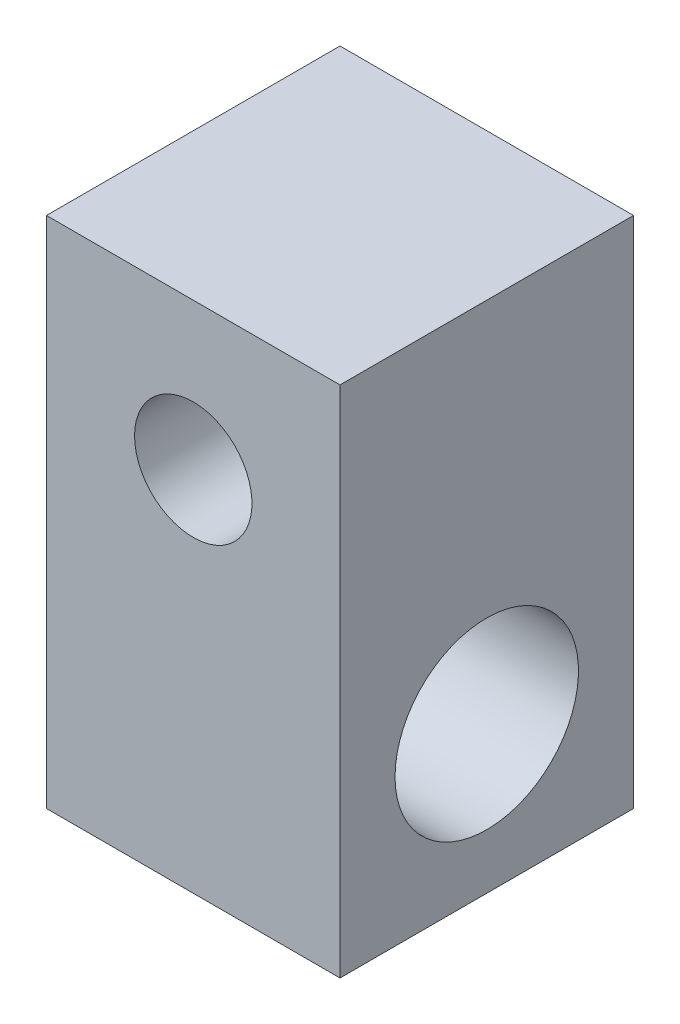
ISO-10303-21;
HEADER;
FILE_DESCRIPTION(('STEP AP214'),'2;1');
FILE_NAME('part.step','',(''),(''),'','','');
FILE_SCHEMA(('AUTOMOTIVE_DESIGN { 1 0 10303 214 1 1 1 1 }'));
ENDSEC;
DATA;
#1=APPLICATION_CONTEXT('core data for automotive mechanical design processes');
#2=APPLICATION_PROTOCOL_DEFINITION('international standard','automotive_design',2000,#1);
#3=PRODUCT_CONTEXT('',#1,'mechanical');
#4=PRODUCT('Part','Part','',(#3));
#5=PRODUCT_RELATED_PRODUCT_CATEGORY('part','',(#4));
#6=PRODUCT_DEFINITION_FORMATION('','',#4);
#7=PRODUCT_DEFINITION_CONTEXT('part definition',#1,'design');
#8=PRODUCT_DEFINITION('design','',#6,#7);
#9=PRODUCT_DEFINITION_SHAPE('','',#8);
#10=(LENGTH_UNIT() NAMED_UNIT(*) SI_UNIT(.MILLI.,.METRE.));
#11=(NAMED_UNIT(*) PLANE_ANGLE_UNIT() SI_UNIT($,.RADIAN.));
#12=(NAMED_UNIT(*) SI_UNIT($,.STERADIAN.) SOLID_ANGLE_UNIT());
#13=UNCERTAINTY_MEASURE_WITH_UNIT(LENGTH_MEASURE(1.E-05),#10,'distance_accuracy_value','');
#14=(GEOMETRIC_REPRESENTATION_CONTEXT(3) GLOBAL_UNCERTAINTY_ASSIGNED_CONTEXT((#13)) GLOBAL_UNIT_ASSIGNED_CONTEXT((#10,
#11,#12)) REPRESENTATION_CONTEXT('',''));
#15=CARTESIAN_POINT('',(0.,0.,0.));
#16=DIRECTION('',(0.,0.,1.));
#17=DIRECTION('',(1.,0.,0.));
#18=AXIS2_PLACEMENT_3D('',#15,#16,#17);
#19=CARTESIAN_POINT('',(-4.,-7.,8.));
#20=DIRECTION('',(1.,0.,0.));
#21=DIRECTION('',(0.,0.,-1.));
#22=AXIS2_PLACEMENT_3D('',#19,#20,#21);
#23=PLANE('',#22);
#24=CARTESIAN_POINT('',(-4.,-2.99999999999999,4.));
#25=DIRECTION('',(-1.,0.,0.));
#26=DIRECTION('',(0.,0.,1.));
#27=AXIS2_PLACEMENT_3D('',#24,#25,#26);
#28=CIRCLE('',#27,2.5);
#29=CARTESIAN_POINT('',(-4.,-2.99999999999999,6.5));
#30=VERTEX_POINT('',#29);
#31=EDGE_CURVE('E114',#30,#30,#28,.T.);
#32=ORIENTED_EDGE('',*,*,#31,.F.);
#33=EDGE_LOOP('',(#32));
#34=FACE_BOUND('',#33,.T.);
#35=DIRECTION('',(0.,-1.,0.));
#36=VECTOR('',#35,1.);
#37=CARTESIAN_POINT('',(-4.,-7.,0.));
#38=LINE('',#37,#36);
#39=CARTESIAN_POINT('',(-4.,7.,0.));
#40=VERTEX_POINT('',#39);
#41=CARTESIAN_POINT('',(-4.,-7.,0.));
#42=VERTEX_POINT('',#41);
#43=EDGE_CURVE('E94',#40,#42,#38,.T.);
#44=ORIENTED_EDGE('',*,*,#43,.T.);
#45=DIRECTION('',(0.,0.,-1.));
#46=VECTOR('',#45,1.);
#47=CARTESIAN_POINT('',(-4.,-7.,8.));
#48=LINE('',#47,#46);
#49=CARTESIAN_POINT('',(-4.,-7.,8.));
#50=VERTEX_POINT('',#49);
#51=EDGE_CURVE('E11',#50,#42,#48,.T.);
#52=ORIENTED_EDGE('',*,*,#51,.F.);
#53=DIRECTION('',(0.,-1.,0.));
#54=VECTOR('',#53,1.);
#55=CARTESIAN_POINT('',(-4.,-7.,8.));
#56=LINE('',#55,#54);
#57=CARTESIAN_POINT('',(-4.,7.,8.));
#58=VERTEX_POINT('',#57);
#59=EDGE_CURVE('E82',#58,#50,#56,.T.);
#60=ORIENTED_EDGE('',*,*,#59,.F.);
#61=DIRECTION('',(0.,0.,-1.));
#62=VECTOR('',#61,1.);
#63=CARTESIAN_POINT('',(-4.,7.,8.));
#64=LINE('',#63,#62);
#65=EDGE_CURVE('E90',#58,#40,#64,.T.);
#66=ORIENTED_EDGE('',*,*,#65,.T.);
#67=EDGE_LOOP('',(#44,#52,#60,#66));
#68=FACE_BOUND('',#67,.T.);
#69=ADVANCED_FACE('F31',(#34,#68),#23,.F.);
#70=CARTESIAN_POINT('',(4.,-7.,8.));
#71=DIRECTION('',(0.,1.,0.));
#72=DIRECTION('',(-1.,0.,0.));
#73=AXIS2_PLACEMENT_3D('',#70,#71,#72);
#74=PLANE('',#73);
#75=DIRECTION('',(1.,0.,0.));
#76=VECTOR('',#75,1.);
#77=CARTESIAN_POINT('',(4.,-7.,0.));
#78=LINE('',#77,#76);
#79=CARTESIAN_POINT('',(4.,-7.,0.));
#80=VERTEX_POINT('',#79);
#81=EDGE_CURVE('E86',#42,#80,#78,.T.);
#82=ORIENTED_EDGE('',*,*,#81,.T.);
#83=DIRECTION('',(0.,0.,-1.));
#84=VECTOR('',#83,1.);
#85=CARTESIAN_POINT('',(4.,-7.,8.));
#86=LINE('',#85,#84);
#87=CARTESIAN_POINT('',(4.,-7.,8.));
#88=VERTEX_POINT('',#87);
#89=EDGE_CURVE('E39',#88,#80,#86,.T.);
#90=ORIENTED_EDGE('',*,*,#89,.F.);
#91=DIRECTION('',(1.,0.,0.));
#92=VECTOR('',#91,1.);
#93=CARTESIAN_POINT('',(4.,-7.,8.));
#94=LINE('',#93,#92);
#95=EDGE_CURVE('E77',#50,#88,#94,.T.);
#96=ORIENTED_EDGE('',*,*,#95,.F.);
#97=ORIENTED_EDGE('',*,*,#51,.T.);
#98=EDGE_LOOP('',(#82,#90,#96,#97));
#99=FACE_BOUND('',#98,.T.);
#100=ADVANCED_FACE('F85',(#99),#74,.F.);
#101=CARTESIAN_POINT('',(4.,-7.,8.));
#102=DIRECTION('',(-1.,0.,0.));
#103=DIRECTION('',(0.,0.,1.));
#104=AXIS2_PLACEMENT_3D('',#101,#102,#103);
#105=PLANE('',#104);
#106=CARTESIAN_POINT('',(4.,-2.99999999999999,4.));
#107=DIRECTION('',(-1.,0.,0.));
#108=DIRECTION('',(0.,0.,1.));
#109=AXIS2_PLACEMENT_3D('',#106,#107,#108);
#110=CIRCLE('',#109,2.5);
#111=CARTESIAN_POINT('',(4.,-2.99999999999999,6.5));
#112=VERTEX_POINT('',#111);
#113=EDGE_CURVE('E111',#112,#112,#110,.T.);
#114=ORIENTED_EDGE('',*,*,#113,.T.);
#115=EDGE_LOOP('',(#114));
#116=FACE_BOUND('',#115,.T.);
#117=DIRECTION('',(0.,1.,0.));
#118=VECTOR('',#117,1.);
#119=CARTESIAN_POINT('',(4.,-7.,0.));
#120=LINE('',#119,#118);
#121=CARTESIAN_POINT('',(4.,7.,0.));
#122=VERTEX_POINT('',#121);
#123=EDGE_CURVE('E64',#80,#122,#120,.T.);
#124=ORIENTED_EDGE('',*,*,#123,.T.);
#125=DIRECTION('',(0.,0.,-1.));
#126=VECTOR('',#125,1.);
#127=CARTESIAN_POINT('',(4.,7.,8.));
#128=LINE('',#127,#126);
#129=CARTESIAN_POINT('',(4.,7.,8.));
#130=VERTEX_POINT('',#129);
#131=EDGE_CURVE('E87',#130,#122,#128,.T.);
#132=ORIENTED_EDGE('',*,*,#131,.F.);
#133=DIRECTION('',(0.,1.,0.));
#134=VECTOR('',#133,1.);
#135=CARTESIAN_POINT('',(4.,-7.,8.));
#136=LINE('',#135,#134);
#137=EDGE_CURVE('E80',#88,#130,#136,.T.);
#138=ORIENTED_EDGE('',*,*,#137,.F.);
#139=ORIENTED_EDGE('',*,*,#89,.T.);
#140=EDGE_LOOP('',(#124,#132,#138,#139));
#141=FACE_BOUND('',#140,.T.);
#142=ADVANCED_FACE('F88',(#116,#141),#105,.F.);
#143=CARTESIAN_POINT('',(4.,7.,8.));
#144=DIRECTION('',(0.,-1.,0.));
#145=DIRECTION('',(1.,0.,0.));
#146=AXIS2_PLACEMENT_3D('',#143,#144,#145);
#147=PLANE('',#146);
#148=DIRECTION('',(-1.,0.,0.));
#149=VECTOR('',#148,1.);
#150=CARTESIAN_POINT('',(4.,7.,0.));
#151=LINE('',#150,#149);
#152=EDGE_CURVE('E70',#122,#40,#151,.T.);
#153=ORIENTED_EDGE('',*,*,#152,.T.);
#154=ORIENTED_EDGE('',*,*,#65,.F.);
#155=DIRECTION('',(-1.,0.,0.));
#156=VECTOR('',#155,1.);
#157=CARTESIAN_POINT('',(4.,7.,8.));
#158=LINE('',#157,#156);
#159=EDGE_CURVE('E47',#130,#58,#158,.T.);
#160=ORIENTED_EDGE('',*,*,#159,.F.);
#161=ORIENTED_EDGE('',*,*,#131,.T.);
#162=EDGE_LOOP('',(#153,#154,#160,#161));
#163=FACE_BOUND('',#162,.T.);
#164=ADVANCED_FACE('F102',(#163),#147,.F.);
#165=CARTESIAN_POINT('',(-4.,7.,8.));
#166=DIRECTION('',(0.,0.,1.));
#167=DIRECTION('',(1.,0.,0.));
#168=AXIS2_PLACEMENT_3D('',#165,#166,#167);
#169=PLANE('',#168);
#170=CARTESIAN_POINT('',(0.,3.00000000000001,8.));
#171=DIRECTION('',(0.,0.,-1.));
#172=DIRECTION('',(-1.,0.,0.));
#173=AXIS2_PLACEMENT_3D('',#170,#171,#172);
#174=CIRCLE('',#173,1.6);
#175=CARTESIAN_POINT('',(-1.6,3.00000000000001,8.));
#176=VERTEX_POINT('',#175);
#177=EDGE_CURVE('E97',#176,#176,#174,.T.);
#178=ORIENTED_EDGE('',*,*,#177,.T.);
#179=EDGE_LOOP('',(#178));
#180=FACE_BOUND('',#179,.T.);
#181=ORIENTED_EDGE('',*,*,#59,.T.);
#182=ORIENTED_EDGE('',*,*,#95,.T.);
#183=ORIENTED_EDGE('',*,*,#137,.T.);
#184=ORIENTED_EDGE('',*,*,#159,.T.);
#185=EDGE_LOOP('',(#181,#182,#183,#184));
#186=FACE_BOUND('',#185,.T.);
#187=ADVANCED_FACE('F78',(#180,#186),#169,.T.);
#188=CARTESIAN_POINT('',(-4.,7.,0.));
#189=DIRECTION('',(0.,0.,1.));
#190=DIRECTION('',(1.,0.,0.));
#191=AXIS2_PLACEMENT_3D('',#188,#189,#190);
#192=PLANE('',#191);
#193=CARTESIAN_POINT('',(0.,3.00000000000001,0.));
#194=DIRECTION('',(0.,0.,-1.));
#195=DIRECTION('',(-1.,0.,0.));
#196=AXIS2_PLACEMENT_3D('',#193,#194,#195);
#197=CIRCLE('',#196,1.6);
#198=CARTESIAN_POINT('',(-1.6,3.00000000000001,0.));
#199=VERTEX_POINT('',#198);
#200=EDGE_CURVE('E108',#199,#199,#197,.T.);
#201=ORIENTED_EDGE('',*,*,#200,.F.);
#202=EDGE_LOOP('',(#201));
#203=FACE_BOUND('',#202,.T.);
#204=ORIENTED_EDGE('',*,*,#43,.F.);
#205=ORIENTED_EDGE('',*,*,#152,.F.);
#206=ORIENTED_EDGE('',*,*,#123,.F.);
#207=ORIENTED_EDGE('',*,*,#81,.F.);
#208=EDGE_LOOP('',(#204,#205,#206,#207));
#209=FACE_BOUND('',#208,.T.);
#210=ADVANCED_FACE('F105',(#203,#209),#192,.F.);
#211=CARTESIAN_POINT('',(0.,3.00000000000001,8.));
#212=DIRECTION('',(0.,0.,-1.));
#213=DIRECTION('',(-1.,0.,0.));
#214=AXIS2_PLACEMENT_3D('',#211,#212,#213);
#215=CYLINDRICAL_SURFACE('',#214,1.6);
#216=ORIENTED_EDGE('',*,*,#177,.F.);
#217=EDGE_LOOP('',(#216));
#218=FACE_BOUND('',#217,.T.);
#219=ORIENTED_EDGE('',*,*,#200,.T.);
#220=EDGE_LOOP('',(#219));
#221=FACE_BOUND('',#220,.T.);
#222=ADVANCED_FACE('F124',(#218,#221),#215,.F.);
#223=CARTESIAN_POINT('',(4.,-2.99999999999999,4.));
#224=DIRECTION('',(-1.,0.,0.));
#225=DIRECTION('',(0.,0.,1.));
#226=AXIS2_PLACEMENT_3D('',#223,#224,#225);
#227=CYLINDRICAL_SURFACE('',#226,2.5);
#228=ORIENTED_EDGE('',*,*,#113,.F.);
#229=EDGE_LOOP('',(#228));
#230=FACE_BOUND('',#229,.T.);
#231=ORIENTED_EDGE('',*,*,#31,.T.);
#232=EDGE_LOOP('',(#231));
#233=FACE_BOUND('',#232,.T.);
#234=ADVANCED_FACE('F121',(#230,#233),#227,.F.);
#235=CLOSED_SHELL('',(#69,#100,#142,#164,#187,#210,#222,#234));
#236=MANIFOLD_SOLID_BREP('B2',#235);
#237=ADVANCED_BREP_SHAPE_REPRESENTATION('',(#18,#236),#14);
#238=SHAPE_DEFINITION_REPRESENTATION(#9,#237);
ENDSEC;
END-ISO-10303-21;
